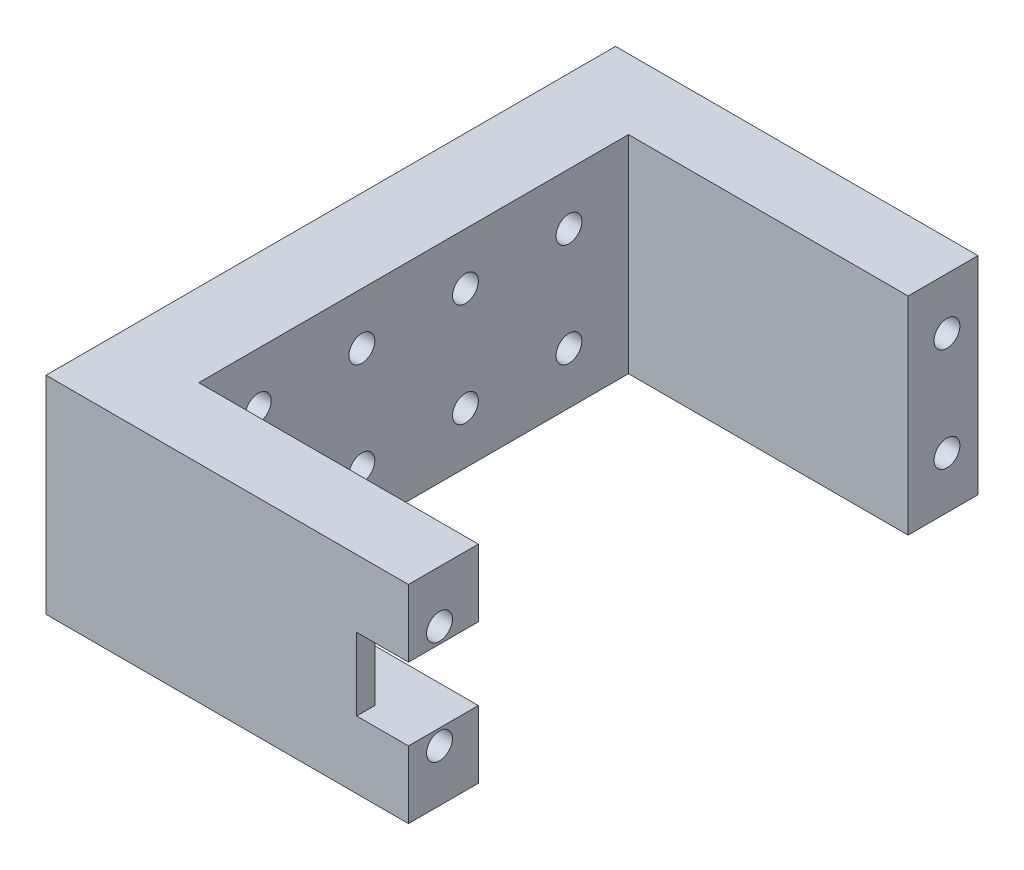
ISO-10303-21;
HEADER;
FILE_DESCRIPTION(('STEP AP214'),'2;1');
FILE_NAME('part.step','',(''),(''),'','','');
FILE_SCHEMA(('AUTOMOTIVE_DESIGN { 1 0 10303 214 1 1 1 1 }'));
ENDSEC;
DATA;
#1=APPLICATION_CONTEXT('core data for automotive mechanical design processes');
#2=APPLICATION_PROTOCOL_DEFINITION('international standard','automotive_design',2000,#1);
#3=PRODUCT_CONTEXT('',#1,'mechanical');
#4=PRODUCT('Part','Part','',(#3));
#5=PRODUCT_RELATED_PRODUCT_CATEGORY('part','',(#4));
#6=PRODUCT_DEFINITION_FORMATION('','',#4);
#7=PRODUCT_DEFINITION_CONTEXT('part definition',#1,'design');
#8=PRODUCT_DEFINITION('design','',#6,#7);
#9=PRODUCT_DEFINITION_SHAPE('','',#8);
#10=(LENGTH_UNIT() NAMED_UNIT(*) SI_UNIT(.MILLI.,.METRE.));
#11=(NAMED_UNIT(*) PLANE_ANGLE_UNIT() SI_UNIT($,.RADIAN.));
#12=(NAMED_UNIT(*) SI_UNIT($,.STERADIAN.) SOLID_ANGLE_UNIT());
#13=UNCERTAINTY_MEASURE_WITH_UNIT(LENGTH_MEASURE(1.E-05),#10,'distance_accuracy_value','');
#14=(GEOMETRIC_REPRESENTATION_CONTEXT(3) GLOBAL_UNCERTAINTY_ASSIGNED_CONTEXT((#13)) GLOBAL_UNIT_ASSIGNED_CONTEXT((#10,
#11,#12)) REPRESENTATION_CONTEXT('',''));
#15=CARTESIAN_POINT('',(0.,0.,0.));
#16=DIRECTION('',(0.,0.,1.));
#17=DIRECTION('',(1.,0.,0.));
#18=AXIS2_PLACEMENT_3D('',#15,#16,#17);
#19=CARTESIAN_POINT('',(17.5,0.,0.));
#20=DIRECTION('',(-1.,0.,0.));
#21=DIRECTION('',(0.,0.,1.));
#22=AXIS2_PLACEMENT_3D('',#19,#20,#21);
#23=PLANE('',#22);
#24=CARTESIAN_POINT('',(17.5,-5.,24.5));
#25=DIRECTION('',(1.,0.,0.));
#26=DIRECTION('',(0.,0.,-1.));
#27=AXIS2_PLACEMENT_3D('',#24,#25,#26);
#28=CIRCLE('',#27,1.25);
#29=CARTESIAN_POINT('',(17.5,-5.,23.25));
#30=VERTEX_POINT('',#29);
#31=EDGE_CURVE('E195',#30,#30,#28,.T.);
#32=ORIENTED_EDGE('',*,*,#31,.F.);
#33=EDGE_LOOP('',(#32));
#34=FACE_BOUND('',#33,.T.);
#35=DIRECTION('',(0.,0.,-1.));
#36=VECTOR('',#35,1.);
#37=CARTESIAN_POINT('',(17.5,-3.5,25.75));
#38=LINE('',#37,#36);
#39=CARTESIAN_POINT('',(17.5,-3.5,27.5));
#40=VERTEX_POINT('',#39);
#41=CARTESIAN_POINT('',(17.5,-3.5,20.75));
#42=VERTEX_POINT('',#41);
#43=EDGE_CURVE('E415',#40,#42,#38,.T.);
#44=ORIENTED_EDGE('',*,*,#43,.F.);
#45=DIRECTION('',(0.,-1.,0.));
#46=VECTOR('',#45,1.);
#47=CARTESIAN_POINT('',(17.5,-10.,27.5));
#48=LINE('',#47,#46);
#49=CARTESIAN_POINT('',(17.5,-10.,27.5));
#50=VERTEX_POINT('',#49);
#51=EDGE_CURVE('E248',#40,#50,#48,.T.);
#52=ORIENTED_EDGE('',*,*,#51,.T.);
#53=DIRECTION('',(0.,0.,-1.));
#54=VECTOR('',#53,1.);
#55=CARTESIAN_POINT('',(17.5,-10.,27.5));
#56=LINE('',#55,#54);
#57=CARTESIAN_POINT('',(17.5,-10.,20.75));
#58=VERTEX_POINT('',#57);
#59=EDGE_CURVE('E253',#50,#58,#56,.T.);
#60=ORIENTED_EDGE('',*,*,#59,.T.);
#61=DIRECTION('',(0.,1.,0.));
#62=VECTOR('',#61,1.);
#63=CARTESIAN_POINT('',(17.5,-10.,20.75));
#64=LINE('',#63,#62);
#65=EDGE_CURVE('E228',#58,#42,#64,.T.);
#66=ORIENTED_EDGE('',*,*,#65,.T.);
#67=EDGE_LOOP('',(#44,#52,#60,#66));
#68=FACE_BOUND('',#67,.T.);
#69=ADVANCED_FACE('F33',(#34,#68),#23,.F.);
#70=CARTESIAN_POINT('',(-18.1023252670426,3.5,25.75));
#71=DIRECTION('',(0.,0.,1.));
#72=DIRECTION('',(1.,0.,0.));
#73=AXIS2_PLACEMENT_3D('',#70,#71,#72);
#74=PLANE('',#73);
#75=DIRECTION('',(0.,1.,0.));
#76=VECTOR('',#75,1.);
#77=CARTESIAN_POINT('',(12.5,-3.5,25.75));
#78=LINE('',#77,#76);
#79=CARTESIAN_POINT('',(12.5,-3.5,25.75));
#80=VERTEX_POINT('',#79);
#81=CARTESIAN_POINT('',(12.5,3.5,25.75));
#82=VERTEX_POINT('',#81);
#83=EDGE_CURVE('E144',#80,#82,#78,.T.);
#84=ORIENTED_EDGE('',*,*,#83,.F.);
#85=DIRECTION('',(1.,0.,0.));
#86=VECTOR('',#85,1.);
#87=CARTESIAN_POINT('',(-18.1023252670426,-3.5,25.75));
#88=LINE('',#87,#86);
#89=CARTESIAN_POINT('',(-9.5,-3.5,25.75));
#90=VERTEX_POINT('',#89);
#91=EDGE_CURVE('E155',#90,#80,#88,.T.);
#92=ORIENTED_EDGE('',*,*,#91,.F.);
#93=DIRECTION('',(0.,-1.,0.));
#94=VECTOR('',#93,1.);
#95=CARTESIAN_POINT('',(-9.5,3.5,25.75));
#96=LINE('',#95,#94);
#97=CARTESIAN_POINT('',(-9.5,3.5,25.75));
#98=VERTEX_POINT('',#97);
#99=EDGE_CURVE('E152',#98,#90,#96,.T.);
#100=ORIENTED_EDGE('',*,*,#99,.F.);
#101=DIRECTION('',(1.,0.,0.));
#102=VECTOR('',#101,1.);
#103=CARTESIAN_POINT('',(-18.1023252670426,3.5,25.75));
#104=LINE('',#103,#102);
#105=EDGE_CURVE('E138',#98,#82,#104,.T.);
#106=ORIENTED_EDGE('',*,*,#105,.T.);
#107=EDGE_LOOP('',(#84,#92,#100,#106));
#108=FACE_BOUND('',#107,.T.);
#109=ADVANCED_FACE('F151',(#108),#74,.F.);
#110=CARTESIAN_POINT('',(17.5,-10.,20.75));
#111=DIRECTION('',(0.,0.,1.));
#112=DIRECTION('',(1.,0.,0.));
#113=AXIS2_PLACEMENT_3D('',#110,#111,#112);
#114=PLANE('',#113);
#115=DIRECTION('',(0.,1.,0.));
#116=VECTOR('',#115,1.);
#117=CARTESIAN_POINT('',(-9.5,-10.,20.75));
#118=LINE('',#117,#116);
#119=CARTESIAN_POINT('',(-9.5,-10.,20.75));
#120=VERTEX_POINT('',#119);
#121=CARTESIAN_POINT('',(-9.5,-3.5,20.75));
#122=VERTEX_POINT('',#121);
#123=EDGE_CURVE('E233',#120,#122,#118,.T.);
#124=ORIENTED_EDGE('',*,*,#123,.T.);
#125=DIRECTION('',(1.,0.,0.));
#126=VECTOR('',#125,1.);
#127=CARTESIAN_POINT('',(-18.1023252670426,-3.5,20.75));
#128=LINE('',#127,#126);
#129=EDGE_CURVE('E161',#122,#42,#128,.T.);
#130=ORIENTED_EDGE('',*,*,#129,.T.);
#131=ORIENTED_EDGE('',*,*,#65,.F.);
#132=DIRECTION('',(1.,0.,0.));
#133=VECTOR('',#132,1.);
#134=CARTESIAN_POINT('',(17.5,-10.,20.75));
#135=LINE('',#134,#133);
#136=EDGE_CURVE('E217',#120,#58,#135,.T.);
#137=ORIENTED_EDGE('',*,*,#136,.F.);
#138=EDGE_LOOP('',(#124,#130,#131,#137));
#139=FACE_BOUND('',#138,.T.);
#140=ADVANCED_FACE('F314',(#139),#114,.F.);
#141=CARTESIAN_POINT('',(-5.5,5.,-15.));
#142=DIRECTION('',(-1.,0.,0.));
#143=DIRECTION('',(0.,0.,1.));
#144=AXIS2_PLACEMENT_3D('',#141,#142,#143);
#145=CYLINDRICAL_SURFACE('',#144,1.25);
#146=CARTESIAN_POINT('',(-17.5,5.,-15.));
#147=DIRECTION('',(-1.,0.,0.));
#148=DIRECTION('',(0.,0.,1.));
#149=AXIS2_PLACEMENT_3D('',#146,#147,#148);
#150=CIRCLE('',#149,1.25);
#151=CARTESIAN_POINT('',(-17.5,5.,-13.75));
#152=VERTEX_POINT('',#151);
#153=EDGE_CURVE('E41',#152,#152,#150,.T.);
#154=ORIENTED_EDGE('',*,*,#153,.T.);
#155=EDGE_LOOP('',(#154));
#156=FACE_BOUND('',#155,.T.);
#157=CARTESIAN_POINT('',(-9.5,5.,-15.));
#158=DIRECTION('',(-1.,0.,0.));
#159=DIRECTION('',(0.,0.,1.));
#160=AXIS2_PLACEMENT_3D('',#157,#158,#159);
#161=CIRCLE('',#160,1.25);
#162=CARTESIAN_POINT('',(-9.5,5.,-13.75));
#163=VERTEX_POINT('',#162);
#164=EDGE_CURVE('E11',#163,#163,#161,.T.);
#165=ORIENTED_EDGE('',*,*,#164,.F.);
#166=EDGE_LOOP('',(#165));
#167=FACE_BOUND('',#166,.T.);
#168=ADVANCED_FACE('F35',(#156,#167),#145,.F.);
#169=CARTESIAN_POINT('',(-5.5,5.,-5.));
#170=DIRECTION('',(-1.,0.,0.));
#171=DIRECTION('',(0.,0.,1.));
#172=AXIS2_PLACEMENT_3D('',#169,#170,#171);
#173=CYLINDRICAL_SURFACE('',#172,1.25);
#174=CARTESIAN_POINT('',(-17.5,5.,-5.));
#175=DIRECTION('',(-1.,0.,0.));
#176=DIRECTION('',(0.,0.,1.));
#177=AXIS2_PLACEMENT_3D('',#174,#175,#176);
#178=CIRCLE('',#177,1.25);
#179=CARTESIAN_POINT('',(-17.5,5.,-3.75));
#180=VERTEX_POINT('',#179);
#181=EDGE_CURVE('E291',#180,#180,#178,.T.);
#182=ORIENTED_EDGE('',*,*,#181,.T.);
#183=EDGE_LOOP('',(#182));
#184=FACE_BOUND('',#183,.T.);
#185=CARTESIAN_POINT('',(-9.5,5.,-5.));
#186=DIRECTION('',(-1.,0.,0.));
#187=DIRECTION('',(0.,0.,1.));
#188=AXIS2_PLACEMENT_3D('',#185,#186,#187);
#189=CIRCLE('',#188,1.25);
#190=CARTESIAN_POINT('',(-9.5,5.,-3.75));
#191=VERTEX_POINT('',#190);
#192=EDGE_CURVE('E294',#191,#191,#189,.T.);
#193=ORIENTED_EDGE('',*,*,#192,.F.);
#194=EDGE_LOOP('',(#193));
#195=FACE_BOUND('',#194,.T.);
#196=ADVANCED_FACE('F390',(#184,#195),#173,.F.);
#197=CARTESIAN_POINT('',(-5.5,-5.,-15.));
#198=DIRECTION('',(-1.,0.,0.));
#199=DIRECTION('',(0.,0.,1.));
#200=AXIS2_PLACEMENT_3D('',#197,#198,#199);
#201=CYLINDRICAL_SURFACE('',#200,1.25);
#202=CARTESIAN_POINT('',(-17.5,-5.,-15.));
#203=DIRECTION('',(-1.,0.,0.));
#204=DIRECTION('',(0.,0.,1.));
#205=AXIS2_PLACEMENT_3D('',#202,#203,#204);
#206=CIRCLE('',#205,1.25);
#207=CARTESIAN_POINT('',(-17.5,-5.,-13.75));
#208=VERTEX_POINT('',#207);
#209=EDGE_CURVE('E285',#208,#208,#206,.T.);
#210=ORIENTED_EDGE('',*,*,#209,.T.);
#211=EDGE_LOOP('',(#210));
#212=FACE_BOUND('',#211,.T.);
#213=CARTESIAN_POINT('',(-9.5,-5.,-15.));
#214=DIRECTION('',(-1.,0.,0.));
#215=DIRECTION('',(0.,0.,1.));
#216=AXIS2_PLACEMENT_3D('',#213,#214,#215);
#217=CIRCLE('',#216,1.25);
#218=CARTESIAN_POINT('',(-9.5,-5.,-13.75));
#219=VERTEX_POINT('',#218);
#220=EDGE_CURVE('E288',#219,#219,#217,.T.);
#221=ORIENTED_EDGE('',*,*,#220,.F.);
#222=EDGE_LOOP('',(#221));
#223=FACE_BOUND('',#222,.T.);
#224=ADVANCED_FACE('F342',(#212,#223),#201,.F.);
#225=CARTESIAN_POINT('',(-5.5,-5.,-5.));
#226=DIRECTION('',(-1.,0.,0.));
#227=DIRECTION('',(0.,0.,1.));
#228=AXIS2_PLACEMENT_3D('',#225,#226,#227);
#229=CYLINDRICAL_SURFACE('',#228,1.25);
#230=CARTESIAN_POINT('',(-17.5,-5.,-5.));
#231=DIRECTION('',(-1.,0.,0.));
#232=DIRECTION('',(0.,0.,1.));
#233=AXIS2_PLACEMENT_3D('',#230,#231,#232);
#234=CIRCLE('',#233,1.25);
#235=CARTESIAN_POINT('',(-17.5,-5.,-3.75));
#236=VERTEX_POINT('',#235);
#237=EDGE_CURVE('E275',#236,#236,#234,.T.);
#238=ORIENTED_EDGE('',*,*,#237,.T.);
#239=EDGE_LOOP('',(#238));
#240=FACE_BOUND('',#239,.T.);
#241=CARTESIAN_POINT('',(-9.5,-5.,-5.));
#242=DIRECTION('',(-1.,0.,0.));
#243=DIRECTION('',(0.,0.,1.));
#244=AXIS2_PLACEMENT_3D('',#241,#242,#243);
#245=CIRCLE('',#244,1.25);
#246=CARTESIAN_POINT('',(-9.5,-5.,-3.75));
#247=VERTEX_POINT('',#246);
#248=EDGE_CURVE('E282',#247,#247,#245,.T.);
#249=ORIENTED_EDGE('',*,*,#248,.F.);
#250=EDGE_LOOP('',(#249));
#251=FACE_BOUND('',#250,.T.);
#252=ADVANCED_FACE('F333',(#240,#251),#229,.F.);
#253=CARTESIAN_POINT('',(17.5,10.,27.5));
#254=VERTEX_POINT('',#253);
#255=CARTESIAN_POINT('',(17.5,3.5,27.5));
#256=VERTEX_POINT('',#255);
#257=EDGE_CURVE('E249',#254,#256,#48,.T.);
#258=ORIENTED_EDGE('',*,*,#257,.T.);
#259=DIRECTION('',(0.,0.,1.));
#260=VECTOR('',#259,1.);
#261=CARTESIAN_POINT('',(17.5,3.5,25.75));
#262=LINE('',#261,#260);
#263=CARTESIAN_POINT('',(17.5,3.5,20.75));
#264=VERTEX_POINT('',#263);
#265=EDGE_CURVE('E414',#264,#256,#262,.T.);
#266=ORIENTED_EDGE('',*,*,#265,.F.);
#267=CARTESIAN_POINT('',(17.5,10.,20.75));
#268=VERTEX_POINT('',#267);
#269=EDGE_CURVE('E232',#264,#268,#64,.T.);
#270=ORIENTED_EDGE('',*,*,#269,.T.);
#271=DIRECTION('',(0.,0.,1.));
#272=VECTOR('',#271,1.);
#273=CARTESIAN_POINT('',(17.5,10.,27.5));
#274=LINE('',#273,#272);
#275=EDGE_CURVE('E243',#268,#254,#274,.T.);
#276=ORIENTED_EDGE('',*,*,#275,.T.);
#277=EDGE_LOOP('',(#258,#266,#270,#276));
#278=FACE_BOUND('',#277,.T.);
#279=CARTESIAN_POINT('',(17.5,5.,24.5));
#280=DIRECTION('',(1.,0.,0.));
#281=DIRECTION('',(0.,0.,-1.));
#282=AXIS2_PLACEMENT_3D('',#279,#280,#281);
#283=CIRCLE('',#282,1.25);
#284=CARTESIAN_POINT('',(17.5,5.,23.25));
#285=VERTEX_POINT('',#284);
#286=EDGE_CURVE('E201',#285,#285,#283,.T.);
#287=ORIENTED_EDGE('',*,*,#286,.F.);
#288=EDGE_LOOP('',(#287));
#289=FACE_BOUND('',#288,.T.);
#290=ADVANCED_FACE('F318',(#278,#289),#23,.F.);
#291=CARTESIAN_POINT('',(17.5,-10.,-27.5));
#292=DIRECTION('',(0.,0.,1.));
#293=DIRECTION('',(1.,0.,0.));
#294=AXIS2_PLACEMENT_3D('',#291,#292,#293);
#295=PLANE('',#294);
#296=DIRECTION('',(0.,1.,0.));
#297=VECTOR('',#296,1.);
#298=CARTESIAN_POINT('',(-17.5,-10.,-27.5));
#299=LINE('',#298,#297);
#300=CARTESIAN_POINT('',(-17.5,-10.,-27.5));
#301=VERTEX_POINT('',#300);
#302=CARTESIAN_POINT('',(-17.5,10.,-27.5));
#303=VERTEX_POINT('',#302);
#304=EDGE_CURVE('E231',#301,#303,#299,.T.);
#305=ORIENTED_EDGE('',*,*,#304,.T.);
#306=DIRECTION('',(-1.,0.,0.));
#307=VECTOR('',#306,1.);
#308=CARTESIAN_POINT('',(17.5,10.,-27.5));
#309=LINE('',#308,#307);
#310=CARTESIAN_POINT('',(17.5,10.,-27.5));
#311=VERTEX_POINT('',#310);
#312=EDGE_CURVE('E272',#311,#303,#309,.T.);
#313=ORIENTED_EDGE('',*,*,#312,.F.);
#314=DIRECTION('',(0.,1.,0.));
#315=VECTOR('',#314,1.);
#316=CARTESIAN_POINT('',(17.5,-10.,-27.5));
#317=LINE('',#316,#315);
#318=CARTESIAN_POINT('',(17.5,-10.,-27.5));
#319=VERTEX_POINT('',#318);
#320=EDGE_CURVE('E240',#319,#311,#317,.T.);
#321=ORIENTED_EDGE('',*,*,#320,.F.);
#322=DIRECTION('',(-1.,0.,0.));
#323=VECTOR('',#322,1.);
#324=CARTESIAN_POINT('',(17.5,-10.,-27.5));
#325=LINE('',#324,#323);
#326=EDGE_CURVE('E256',#319,#301,#325,.T.);
#327=ORIENTED_EDGE('',*,*,#326,.T.);
#328=EDGE_LOOP('',(#305,#313,#321,#327));
#329=FACE_BOUND('',#328,.T.);
#330=ADVANCED_FACE('F332',(#329),#295,.F.);
#331=CARTESIAN_POINT('',(17.5,10.,27.5));
#332=DIRECTION('',(0.,-1.,0.));
#333=DIRECTION('',(0.,0.,-1.));
#334=AXIS2_PLACEMENT_3D('',#331,#332,#333);
#335=PLANE('',#334);
#336=ORIENTED_EDGE('',*,*,#275,.F.);
#337=DIRECTION('',(1.,0.,0.));
#338=VECTOR('',#337,1.);
#339=CARTESIAN_POINT('',(17.5,10.,20.75));
#340=LINE('',#339,#338);
#341=CARTESIAN_POINT('',(-9.5,10.,20.75));
#342=VERTEX_POINT('',#341);
#343=EDGE_CURVE('E214',#342,#268,#340,.T.);
#344=ORIENTED_EDGE('',*,*,#343,.F.);
#345=DIRECTION('',(0.,0.,1.));
#346=VECTOR('',#345,1.);
#347=CARTESIAN_POINT('',(-9.5,10.,-20.75));
#348=LINE('',#347,#346);
#349=CARTESIAN_POINT('',(-9.5,10.,-20.75));
#350=VERTEX_POINT('',#349);
#351=EDGE_CURVE('E223',#350,#342,#348,.T.);
#352=ORIENTED_EDGE('',*,*,#351,.F.);
#353=DIRECTION('',(-1.,0.,0.));
#354=VECTOR('',#353,1.);
#355=CARTESIAN_POINT('',(17.5,10.,-20.75));
#356=LINE('',#355,#354);
#357=CARTESIAN_POINT('',(17.5,10.,-20.75));
#358=VERTEX_POINT('',#357);
#359=EDGE_CURVE('E207',#358,#350,#356,.T.);
#360=ORIENTED_EDGE('',*,*,#359,.F.);
#361=EDGE_CURVE('E245',#311,#358,#274,.T.);
#362=ORIENTED_EDGE('',*,*,#361,.F.);
#363=ORIENTED_EDGE('',*,*,#312,.T.);
#364=DIRECTION('',(0.,0.,1.));
#365=VECTOR('',#364,1.);
#366=CARTESIAN_POINT('',(-17.5,10.,27.5));
#367=LINE('',#366,#365);
#368=CARTESIAN_POINT('',(-17.5,10.,27.5));
#369=VERTEX_POINT('',#368);
#370=EDGE_CURVE('E259',#303,#369,#367,.T.);
#371=ORIENTED_EDGE('',*,*,#370,.T.);
#372=DIRECTION('',(-1.,0.,0.));
#373=VECTOR('',#372,1.);
#374=CARTESIAN_POINT('',(17.5,10.,27.5));
#375=LINE('',#374,#373);
#376=EDGE_CURVE('E269',#254,#369,#375,.T.);
#377=ORIENTED_EDGE('',*,*,#376,.F.);
#378=EDGE_LOOP('',(#336,#344,#352,#360,#362,#363,#371,#377));
#379=FACE_BOUND('',#378,.T.);
#380=ADVANCED_FACE('F339',(#379),#335,.F.);
#381=CARTESIAN_POINT('',(17.5,-10.,27.5));
#382=DIRECTION('',(0.,0.,-1.));
#383=DIRECTION('',(-1.,0.,0.));
#384=AXIS2_PLACEMENT_3D('',#381,#382,#383);
#385=PLANE('',#384);
#386=ORIENTED_EDGE('',*,*,#51,.F.);
#387=DIRECTION('',(1.,0.,0.));
#388=VECTOR('',#387,1.);
#389=CARTESIAN_POINT('',(12.5,-3.5,27.5));
#390=LINE('',#389,#388);
#391=CARTESIAN_POINT('',(12.5,-3.5,27.5));
#392=VERTEX_POINT('',#391);
#393=EDGE_CURVE('E418',#392,#40,#390,.T.);
#394=ORIENTED_EDGE('',*,*,#393,.F.);
#395=DIRECTION('',(0.,-1.,0.));
#396=VECTOR('',#395,1.);
#397=CARTESIAN_POINT('',(12.5,-3.5,27.5));
#398=LINE('',#397,#396);
#399=CARTESIAN_POINT('',(12.5,3.5,27.5));
#400=VERTEX_POINT('',#399);
#401=EDGE_CURVE('E143',#400,#392,#398,.T.);
#402=ORIENTED_EDGE('',*,*,#401,.F.);
#403=DIRECTION('',(1.,0.,0.));
#404=VECTOR('',#403,1.);
#405=CARTESIAN_POINT('',(12.5,3.5,27.5));
#406=LINE('',#405,#404);
#407=EDGE_CURVE('E141',#400,#256,#406,.T.);
#408=ORIENTED_EDGE('',*,*,#407,.T.);
#409=ORIENTED_EDGE('',*,*,#257,.F.);
#410=ORIENTED_EDGE('',*,*,#376,.T.);
#411=DIRECTION('',(0.,-1.,0.));
#412=VECTOR('',#411,1.);
#413=CARTESIAN_POINT('',(-17.5,-10.,27.5));
#414=LINE('',#413,#412);
#415=CARTESIAN_POINT('',(-17.5,-10.,27.5));
#416=VERTEX_POINT('',#415);
#417=EDGE_CURVE('E261',#369,#416,#414,.T.);
#418=ORIENTED_EDGE('',*,*,#417,.T.);
#419=DIRECTION('',(-1.,0.,0.));
#420=VECTOR('',#419,1.);
#421=CARTESIAN_POINT('',(17.5,-10.,27.5));
#422=LINE('',#421,#420);
#423=EDGE_CURVE('E266',#50,#416,#422,.T.);
#424=ORIENTED_EDGE('',*,*,#423,.F.);
#425=EDGE_LOOP('',(#386,#394,#402,#408,#409,#410,#418,#424));
#426=FACE_BOUND('',#425,.T.);
#427=ADVANCED_FACE('F430',(#426),#385,.F.);
#428=CARTESIAN_POINT('',(17.5,-10.,27.5));
#429=DIRECTION('',(0.,1.,0.));
#430=DIRECTION('',(0.,0.,1.));
#431=AXIS2_PLACEMENT_3D('',#428,#429,#430);
#432=PLANE('',#431);
#433=DIRECTION('',(0.,0.,1.));
#434=VECTOR('',#433,1.);
#435=CARTESIAN_POINT('',(-9.5,-10.,-20.75));
#436=LINE('',#435,#434);
#437=CARTESIAN_POINT('',(-9.5,-10.,-20.75));
#438=VERTEX_POINT('',#437);
#439=EDGE_CURVE('E213',#438,#120,#436,.T.);
#440=ORIENTED_EDGE('',*,*,#439,.T.);
#441=ORIENTED_EDGE('',*,*,#136,.T.);
#442=ORIENTED_EDGE('',*,*,#59,.F.);
#443=ORIENTED_EDGE('',*,*,#423,.T.);
#444=DIRECTION('',(0.,0.,-1.));
#445=VECTOR('',#444,1.);
#446=CARTESIAN_POINT('',(-17.5,-10.,27.5));
#447=LINE('',#446,#445);
#448=EDGE_CURVE('E244',#416,#301,#447,.T.);
#449=ORIENTED_EDGE('',*,*,#448,.T.);
#450=ORIENTED_EDGE('',*,*,#326,.F.);
#451=CARTESIAN_POINT('',(17.5,-10.,-20.75));
#452=VERTEX_POINT('',#451);
#453=EDGE_CURVE('E252',#452,#319,#56,.T.);
#454=ORIENTED_EDGE('',*,*,#453,.F.);
#455=DIRECTION('',(-1.,0.,0.));
#456=VECTOR('',#455,1.);
#457=CARTESIAN_POINT('',(17.5,-10.,-20.75));
#458=LINE('',#457,#456);
#459=EDGE_CURVE('E210',#452,#438,#458,.T.);
#460=ORIENTED_EDGE('',*,*,#459,.T.);
#461=EDGE_LOOP('',(#440,#441,#442,#443,#449,#450,#454,#460));
#462=FACE_BOUND('',#461,.T.);
#463=ADVANCED_FACE('F315',(#462),#432,.F.);
#464=CARTESIAN_POINT('',(17.5,-5.,-24.5));
#465=DIRECTION('',(-1.,0.,0.));
#466=DIRECTION('',(0.,0.,1.));
#467=AXIS2_PLACEMENT_3D('',#464,#465,#466);
#468=CIRCLE('',#467,1.25);
#469=CARTESIAN_POINT('',(17.5,-5.,-23.25));
#470=VERTEX_POINT('',#469);
#471=EDGE_CURVE('E189',#470,#470,#468,.T.);
#472=ORIENTED_EDGE('',*,*,#471,.T.);
#473=EDGE_LOOP('',(#472));
#474=FACE_BOUND('',#473,.T.);
#475=CARTESIAN_POINT('',(17.5,5.,-24.5));
#476=DIRECTION('',(-1.,0.,0.));
#477=DIRECTION('',(0.,0.,1.));
#478=AXIS2_PLACEMENT_3D('',#475,#476,#477);
#479=CIRCLE('',#478,1.25);
#480=CARTESIAN_POINT('',(17.5,5.,-23.25));
#481=VERTEX_POINT('',#480);
#482=EDGE_CURVE('E188',#481,#481,#479,.T.);
#483=ORIENTED_EDGE('',*,*,#482,.T.);
#484=EDGE_LOOP('',(#483));
#485=FACE_BOUND('',#484,.T.);
#486=ORIENTED_EDGE('',*,*,#361,.T.);
#487=DIRECTION('',(0.,1.,0.));
#488=VECTOR('',#487,1.);
#489=CARTESIAN_POINT('',(17.5,-10.,-20.75));
#490=LINE('',#489,#488);
#491=EDGE_CURVE('E220',#452,#358,#490,.T.);
#492=ORIENTED_EDGE('',*,*,#491,.F.);
#493=ORIENTED_EDGE('',*,*,#453,.T.);
#494=ORIENTED_EDGE('',*,*,#320,.T.);
#495=EDGE_LOOP('',(#486,#492,#493,#494));
#496=FACE_BOUND('',#495,.T.);
#497=ADVANCED_FACE('F304',(#474,#485,#496),#23,.F.);
#498=CARTESIAN_POINT('',(-17.5,0.,0.));
#499=DIRECTION('',(-1.,0.,0.));
#500=DIRECTION('',(0.,0.,1.));
#501=AXIS2_PLACEMENT_3D('',#498,#499,#500);
#502=PLANE('',#501);
#503=CARTESIAN_POINT('',(-17.5,5.,5.));
#504=DIRECTION('',(-1.,0.,0.));
#505=DIRECTION('',(0.,0.,1.));
#506=AXIS2_PLACEMENT_3D('',#503,#504,#505);
#507=CIRCLE('',#506,1.25);
#508=CARTESIAN_POINT('',(-17.5,5.,6.25));
#509=VERTEX_POINT('',#508);
#510=EDGE_CURVE('E165',#509,#509,#507,.T.);
#511=ORIENTED_EDGE('',*,*,#510,.F.);
#512=EDGE_LOOP('',(#511));
#513=FACE_BOUND('',#512,.T.);
#514=CARTESIAN_POINT('',(-17.5,-5.,5.));
#515=DIRECTION('',(-1.,0.,0.));
#516=DIRECTION('',(0.,0.,1.));
#517=AXIS2_PLACEMENT_3D('',#514,#515,#516);
#518=CIRCLE('',#517,1.25);
#519=CARTESIAN_POINT('',(-17.5,-5.,6.25));
#520=VERTEX_POINT('',#519);
#521=EDGE_CURVE('E171',#520,#520,#518,.T.);
#522=ORIENTED_EDGE('',*,*,#521,.F.);
#523=EDGE_LOOP('',(#522));
#524=FACE_BOUND('',#523,.T.);
#525=CARTESIAN_POINT('',(-17.5,-5.,15.));
#526=DIRECTION('',(-1.,0.,0.));
#527=DIRECTION('',(0.,0.,1.));
#528=AXIS2_PLACEMENT_3D('',#525,#526,#527);
#529=CIRCLE('',#528,1.25);
#530=CARTESIAN_POINT('',(-17.5,-5.,16.25));
#531=VERTEX_POINT('',#530);
#532=EDGE_CURVE('E177',#531,#531,#529,.T.);
#533=ORIENTED_EDGE('',*,*,#532,.F.);
#534=EDGE_LOOP('',(#533));
#535=FACE_BOUND('',#534,.T.);
#536=CARTESIAN_POINT('',(-17.5,5.,15.));
#537=DIRECTION('',(-1.,0.,0.));
#538=DIRECTION('',(0.,0.,1.));
#539=AXIS2_PLACEMENT_3D('',#536,#537,#538);
#540=CIRCLE('',#539,1.25);
#541=CARTESIAN_POINT('',(-17.5,5.,16.25));
#542=VERTEX_POINT('',#541);
#543=EDGE_CURVE('E181',#542,#542,#540,.T.);
#544=ORIENTED_EDGE('',*,*,#543,.F.);
#545=EDGE_LOOP('',(#544));
#546=FACE_BOUND('',#545,.T.);
#547=ORIENTED_EDGE('',*,*,#304,.F.);
#548=ORIENTED_EDGE('',*,*,#448,.F.);
#549=ORIENTED_EDGE('',*,*,#417,.F.);
#550=ORIENTED_EDGE('',*,*,#370,.F.);
#551=EDGE_LOOP('',(#547,#548,#549,#550));
#552=FACE_BOUND('',#551,.T.);
#553=ORIENTED_EDGE('',*,*,#237,.F.);
#554=EDGE_LOOP('',(#553));
#555=FACE_BOUND('',#554,.T.);
#556=ORIENTED_EDGE('',*,*,#209,.F.);
#557=EDGE_LOOP('',(#556));
#558=FACE_BOUND('',#557,.T.);
#559=ORIENTED_EDGE('',*,*,#181,.F.);
#560=EDGE_LOOP('',(#559));
#561=FACE_BOUND('',#560,.T.);
#562=ORIENTED_EDGE('',*,*,#153,.F.);
#563=EDGE_LOOP('',(#562));
#564=FACE_BOUND('',#563,.T.);
#565=ADVANCED_FACE('F301',(#513,#524,#535,#546,#552,#555,#558,#561,#564),#502,.T.);
#566=ORIENTED_EDGE('',*,*,#269,.F.);
#567=DIRECTION('',(1.,0.,0.));
#568=VECTOR('',#567,1.);
#569=CARTESIAN_POINT('',(-18.1023252670426,3.5,20.75));
#570=LINE('',#569,#568);
#571=CARTESIAN_POINT('',(-9.5,3.5,20.75));
#572=VERTEX_POINT('',#571);
#573=EDGE_CURVE('E157',#572,#264,#570,.T.);
#574=ORIENTED_EDGE('',*,*,#573,.F.);
#575=EDGE_CURVE('E236',#572,#342,#118,.T.);
#576=ORIENTED_EDGE('',*,*,#575,.T.);
#577=ORIENTED_EDGE('',*,*,#343,.T.);
#578=EDGE_LOOP('',(#566,#574,#576,#577));
#579=FACE_BOUND('',#578,.T.);
#580=ADVANCED_FACE('F303',(#579),#114,.F.);
#581=CARTESIAN_POINT('',(-9.5,-10.,-20.75));
#582=DIRECTION('',(-1.,0.,0.));
#583=DIRECTION('',(0.,0.,1.));
#584=AXIS2_PLACEMENT_3D('',#581,#582,#583);
#585=PLANE('',#584);
#586=CARTESIAN_POINT('',(-9.5,5.,5.));
#587=DIRECTION('',(-1.,0.,0.));
#588=DIRECTION('',(0.,0.,1.));
#589=AXIS2_PLACEMENT_3D('',#586,#587,#588);
#590=CIRCLE('',#589,1.25);
#591=CARTESIAN_POINT('',(-9.5,5.,6.25));
#592=VERTEX_POINT('',#591);
#593=EDGE_CURVE('E168',#592,#592,#590,.T.);
#594=ORIENTED_EDGE('',*,*,#593,.T.);
#595=EDGE_LOOP('',(#594));
#596=FACE_BOUND('',#595,.T.);
#597=CARTESIAN_POINT('',(-9.5,-5.,5.));
#598=DIRECTION('',(-1.,0.,0.));
#599=DIRECTION('',(0.,0.,1.));
#600=AXIS2_PLACEMENT_3D('',#597,#598,#599);
#601=CIRCLE('',#600,1.25);
#602=CARTESIAN_POINT('',(-9.5,-5.,6.25));
#603=VERTEX_POINT('',#602);
#604=EDGE_CURVE('E174',#603,#603,#601,.T.);
#605=ORIENTED_EDGE('',*,*,#604,.T.);
#606=EDGE_LOOP('',(#605));
#607=FACE_BOUND('',#606,.T.);
#608=CARTESIAN_POINT('',(-9.5,-5.,15.));
#609=DIRECTION('',(-1.,0.,0.));
#610=DIRECTION('',(0.,0.,1.));
#611=AXIS2_PLACEMENT_3D('',#608,#609,#610);
#612=CIRCLE('',#611,1.25);
#613=CARTESIAN_POINT('',(-9.5,-5.,16.25));
#614=VERTEX_POINT('',#613);
#615=EDGE_CURVE('E180',#614,#614,#612,.T.);
#616=ORIENTED_EDGE('',*,*,#615,.T.);
#617=EDGE_LOOP('',(#616));
#618=FACE_BOUND('',#617,.T.);
#619=CARTESIAN_POINT('',(-9.5,5.,15.));
#620=DIRECTION('',(-1.,0.,0.));
#621=DIRECTION('',(0.,0.,1.));
#622=AXIS2_PLACEMENT_3D('',#619,#620,#621);
#623=CIRCLE('',#622,1.25);
#624=CARTESIAN_POINT('',(-9.5,5.,16.25));
#625=VERTEX_POINT('',#624);
#626=EDGE_CURVE('E184',#625,#625,#623,.T.);
#627=ORIENTED_EDGE('',*,*,#626,.T.);
#628=EDGE_LOOP('',(#627));
#629=FACE_BOUND('',#628,.T.);
#630=ORIENTED_EDGE('',*,*,#351,.T.);
#631=ORIENTED_EDGE('',*,*,#575,.F.);
#632=DIRECTION('',(0.,0.,1.));
#633=VECTOR('',#632,1.);
#634=CARTESIAN_POINT('',(-9.5,3.5,25.75));
#635=LINE('',#634,#633);
#636=EDGE_CURVE('E153',#572,#98,#635,.T.);
#637=ORIENTED_EDGE('',*,*,#636,.T.);
#638=ORIENTED_EDGE('',*,*,#99,.T.);
#639=DIRECTION('',(0.,0.,-1.));
#640=VECTOR('',#639,1.);
#641=CARTESIAN_POINT('',(-9.5,-3.5,25.75));
#642=LINE('',#641,#640);
#643=EDGE_CURVE('E56',#90,#122,#642,.T.);
#644=ORIENTED_EDGE('',*,*,#643,.T.);
#645=ORIENTED_EDGE('',*,*,#123,.F.);
#646=ORIENTED_EDGE('',*,*,#439,.F.);
#647=DIRECTION('',(0.,1.,0.));
#648=VECTOR('',#647,1.);
#649=CARTESIAN_POINT('',(-9.5,-10.,-20.75));
#650=LINE('',#649,#648);
#651=EDGE_CURVE('E237',#438,#350,#650,.T.);
#652=ORIENTED_EDGE('',*,*,#651,.T.);
#653=EDGE_LOOP('',(#630,#631,#637,#638,#644,#645,#646,#652));
#654=FACE_BOUND('',#653,.T.);
#655=ORIENTED_EDGE('',*,*,#248,.T.);
#656=EDGE_LOOP('',(#655));
#657=FACE_BOUND('',#656,.T.);
#658=ORIENTED_EDGE('',*,*,#220,.T.);
#659=EDGE_LOOP('',(#658));
#660=FACE_BOUND('',#659,.T.);
#661=ORIENTED_EDGE('',*,*,#192,.T.);
#662=EDGE_LOOP('',(#661));
#663=FACE_BOUND('',#662,.T.);
#664=ORIENTED_EDGE('',*,*,#164,.T.);
#665=EDGE_LOOP('',(#664));
#666=FACE_BOUND('',#665,.T.);
#667=ADVANCED_FACE('F311',(#596,#607,#618,#629,#654,#657,#660,#663,#666),#585,.F.);
#668=CARTESIAN_POINT('',(17.5,-10.,-20.75));
#669=DIRECTION('',(0.,0.,-1.));
#670=DIRECTION('',(-1.,0.,0.));
#671=AXIS2_PLACEMENT_3D('',#668,#669,#670);
#672=PLANE('',#671);
#673=ORIENTED_EDGE('',*,*,#359,.T.);
#674=ORIENTED_EDGE('',*,*,#651,.F.);
#675=ORIENTED_EDGE('',*,*,#459,.F.);
#676=ORIENTED_EDGE('',*,*,#491,.T.);
#677=EDGE_LOOP('',(#673,#674,#675,#676));
#678=FACE_BOUND('',#677,.T.);
#679=ADVANCED_FACE('F353',(#678),#672,.F.);
#680=CARTESIAN_POINT('',(5.5,5.,24.5));
#681=DIRECTION('',(1.,0.,0.));
#682=DIRECTION('',(0.,0.,-1.));
#683=AXIS2_PLACEMENT_3D('',#680,#681,#682);
#684=CYLINDRICAL_SURFACE('',#683,1.25);
#685=CARTESIAN_POINT('',(5.5,5.,24.5));
#686=DIRECTION('',(1.,0.,0.));
#687=DIRECTION('',(0.,0.,-1.));
#688=AXIS2_PLACEMENT_3D('',#685,#686,#687);
#689=CIRCLE('',#688,1.25);
#690=CARTESIAN_POINT('',(5.5,5.,23.25));
#691=VERTEX_POINT('',#690);
#692=EDGE_CURVE('E204',#691,#691,#689,.T.);
#693=ORIENTED_EDGE('',*,*,#692,.F.);
#694=EDGE_LOOP('',(#693));
#695=FACE_BOUND('',#694,.T.);
#696=ORIENTED_EDGE('',*,*,#286,.T.);
#697=EDGE_LOOP('',(#696));
#698=FACE_BOUND('',#697,.T.);
#699=ADVANCED_FACE('F350',(#695,#698),#684,.F.);
#700=CARTESIAN_POINT('',(5.5,5.,24.5));
#701=DIRECTION('',(1.,0.,0.));
#702=DIRECTION('',(0.,0.,-1.));
#703=AXIS2_PLACEMENT_3D('',#700,#701,#702);
#704=PLANE('',#703);
#705=ORIENTED_EDGE('',*,*,#692,.T.);
#706=EDGE_LOOP('',(#705));
#707=FACE_BOUND('',#706,.T.);
#708=ADVANCED_FACE('F352',(#707),#704,.T.);
#709=CARTESIAN_POINT('',(5.5,-5.,24.5));
#710=DIRECTION('',(1.,0.,0.));
#711=DIRECTION('',(0.,0.,-1.));
#712=AXIS2_PLACEMENT_3D('',#709,#710,#711);
#713=CYLINDRICAL_SURFACE('',#712,1.25);
#714=CARTESIAN_POINT('',(5.5,-5.,24.5));
#715=DIRECTION('',(1.,0.,0.));
#716=DIRECTION('',(0.,0.,-1.));
#717=AXIS2_PLACEMENT_3D('',#714,#715,#716);
#718=CIRCLE('',#717,1.25);
#719=CARTESIAN_POINT('',(5.5,-5.,23.25));
#720=VERTEX_POINT('',#719);
#721=EDGE_CURVE('E198',#720,#720,#718,.T.);
#722=ORIENTED_EDGE('',*,*,#721,.F.);
#723=EDGE_LOOP('',(#722));
#724=FACE_BOUND('',#723,.T.);
#725=ORIENTED_EDGE('',*,*,#31,.T.);
#726=EDGE_LOOP('',(#725));
#727=FACE_BOUND('',#726,.T.);
#728=ADVANCED_FACE('F360',(#724,#727),#713,.F.);
#729=CARTESIAN_POINT('',(5.5,-5.,24.5));
#730=DIRECTION('',(1.,0.,0.));
#731=DIRECTION('',(0.,0.,-1.));
#732=AXIS2_PLACEMENT_3D('',#729,#730,#731);
#733=PLANE('',#732);
#734=ORIENTED_EDGE('',*,*,#721,.T.);
#735=EDGE_LOOP('',(#734));
#736=FACE_BOUND('',#735,.T.);
#737=ADVANCED_FACE('F472',(#736),#733,.T.);
#738=CARTESIAN_POINT('',(5.5,5.,-24.5));
#739=DIRECTION('',(1.,0.,0.));
#740=DIRECTION('',(0.,0.,-1.));
#741=AXIS2_PLACEMENT_3D('',#738,#739,#740);
#742=CYLINDRICAL_SURFACE('',#741,1.25);
#743=CARTESIAN_POINT('',(5.5,5.,-24.5));
#744=DIRECTION('',(-1.,0.,0.));
#745=DIRECTION('',(0.,0.,1.));
#746=AXIS2_PLACEMENT_3D('',#743,#744,#745);
#747=CIRCLE('',#746,1.25);
#748=CARTESIAN_POINT('',(5.5,5.,-23.25));
#749=VERTEX_POINT('',#748);
#750=EDGE_CURVE('E192',#749,#749,#747,.T.);
#751=ORIENTED_EDGE('',*,*,#750,.T.);
#752=EDGE_LOOP('',(#751));
#753=FACE_BOUND('',#752,.T.);
#754=ORIENTED_EDGE('',*,*,#482,.F.);
#755=EDGE_LOOP('',(#754));
#756=FACE_BOUND('',#755,.T.);
#757=ADVANCED_FACE('F477',(#753,#756),#742,.F.);
#758=CARTESIAN_POINT('',(5.5,5.,-24.5));
#759=DIRECTION('',(1.,0.,0.));
#760=DIRECTION('',(0.,0.,1.));
#761=AXIS2_PLACEMENT_3D('',#758,#759,#760);
#762=PLANE('',#761);
#763=ORIENTED_EDGE('',*,*,#750,.F.);
#764=EDGE_LOOP('',(#763));
#765=FACE_BOUND('',#764,.T.);
#766=ADVANCED_FACE('F482',(#765),#762,.T.);
#767=CARTESIAN_POINT('',(5.5,-5.,-24.5));
#768=DIRECTION('',(1.,0.,0.));
#769=DIRECTION('',(0.,0.,-1.));
#770=AXIS2_PLACEMENT_3D('',#767,#768,#769);
#771=CYLINDRICAL_SURFACE('',#770,1.25);
#772=CARTESIAN_POINT('',(5.5,-5.,-24.5));
#773=DIRECTION('',(-1.,0.,0.));
#774=DIRECTION('',(0.,0.,1.));
#775=AXIS2_PLACEMENT_3D('',#772,#773,#774);
#776=CIRCLE('',#775,1.25);
#777=CARTESIAN_POINT('',(5.5,-5.,-23.25));
#778=VERTEX_POINT('',#777);
#779=EDGE_CURVE('E185',#778,#778,#776,.T.);
#780=ORIENTED_EDGE('',*,*,#779,.T.);
#781=EDGE_LOOP('',(#780));
#782=FACE_BOUND('',#781,.T.);
#783=ORIENTED_EDGE('',*,*,#471,.F.);
#784=EDGE_LOOP('',(#783));
#785=FACE_BOUND('',#784,.T.);
#786=ADVANCED_FACE('F492',(#782,#785),#771,.F.);
#787=CARTESIAN_POINT('',(5.5,-5.,-24.5));
#788=DIRECTION('',(1.,0.,0.));
#789=DIRECTION('',(0.,0.,1.));
#790=AXIS2_PLACEMENT_3D('',#787,#788,#789);
#791=PLANE('',#790);
#792=ORIENTED_EDGE('',*,*,#779,.F.);
#793=EDGE_LOOP('',(#792));
#794=FACE_BOUND('',#793,.T.);
#795=ADVANCED_FACE('F502',(#794),#791,.T.);
#796=CARTESIAN_POINT('',(-5.5,5.,15.));
#797=DIRECTION('',(-1.,0.,0.));
#798=DIRECTION('',(0.,0.,1.));
#799=AXIS2_PLACEMENT_3D('',#796,#797,#798);
#800=CYLINDRICAL_SURFACE('',#799,1.25);
#801=ORIENTED_EDGE('',*,*,#543,.T.);
#802=EDGE_LOOP('',(#801));
#803=FACE_BOUND('',#802,.T.);
#804=ORIENTED_EDGE('',*,*,#626,.F.);
#805=EDGE_LOOP('',(#804));
#806=FACE_BOUND('',#805,.T.);
#807=ADVANCED_FACE('F512',(#803,#806),#800,.F.);
#808=CARTESIAN_POINT('',(-5.5,-5.,15.));
#809=DIRECTION('',(-1.,0.,0.));
#810=DIRECTION('',(0.,0.,1.));
#811=AXIS2_PLACEMENT_3D('',#808,#809,#810);
#812=CYLINDRICAL_SURFACE('',#811,1.25);
#813=ORIENTED_EDGE('',*,*,#532,.T.);
#814=EDGE_LOOP('',(#813));
#815=FACE_BOUND('',#814,.T.);
#816=ORIENTED_EDGE('',*,*,#615,.F.);
#817=EDGE_LOOP('',(#816));
#818=FACE_BOUND('',#817,.T.);
#819=ADVANCED_FACE('F522',(#815,#818),#812,.F.);
#820=CARTESIAN_POINT('',(-5.5,-5.,5.));
#821=DIRECTION('',(-1.,0.,0.));
#822=DIRECTION('',(0.,0.,1.));
#823=AXIS2_PLACEMENT_3D('',#820,#821,#822);
#824=CYLINDRICAL_SURFACE('',#823,1.25);
#825=ORIENTED_EDGE('',*,*,#521,.T.);
#826=EDGE_LOOP('',(#825));
#827=FACE_BOUND('',#826,.T.);
#828=ORIENTED_EDGE('',*,*,#604,.F.);
#829=EDGE_LOOP('',(#828));
#830=FACE_BOUND('',#829,.T.);
#831=ADVANCED_FACE('F531',(#827,#830),#824,.F.);
#832=CARTESIAN_POINT('',(-5.5,5.,5.));
#833=DIRECTION('',(-1.,0.,0.));
#834=DIRECTION('',(0.,0.,1.));
#835=AXIS2_PLACEMENT_3D('',#832,#833,#834);
#836=CYLINDRICAL_SURFACE('',#835,1.25);
#837=ORIENTED_EDGE('',*,*,#510,.T.);
#838=EDGE_LOOP('',(#837));
#839=FACE_BOUND('',#838,.T.);
#840=ORIENTED_EDGE('',*,*,#593,.F.);
#841=EDGE_LOOP('',(#840));
#842=FACE_BOUND('',#841,.T.);
#843=ADVANCED_FACE('F566',(#839,#842),#836,.F.);
#844=CARTESIAN_POINT('',(-18.1023252670426,-3.5,25.75));
#845=DIRECTION('',(0.,-1.,0.));
#846=DIRECTION('',(0.,0.,-1.));
#847=AXIS2_PLACEMENT_3D('',#844,#845,#846);
#848=PLANE('',#847);
#849=ORIENTED_EDGE('',*,*,#91,.T.);
#850=DIRECTION('',(0.,0.,-1.));
#851=VECTOR('',#850,1.);
#852=CARTESIAN_POINT('',(12.5,-3.5,25.75));
#853=LINE('',#852,#851);
#854=EDGE_CURVE('E48',#392,#80,#853,.T.);
#855=ORIENTED_EDGE('',*,*,#854,.F.);
#856=ORIENTED_EDGE('',*,*,#393,.T.);
#857=ORIENTED_EDGE('',*,*,#43,.T.);
#858=ORIENTED_EDGE('',*,*,#129,.F.);
#859=ORIENTED_EDGE('',*,*,#643,.F.);
#860=EDGE_LOOP('',(#849,#855,#856,#857,#858,#859));
#861=FACE_BOUND('',#860,.T.);
#862=ADVANCED_FACE('F428',(#861),#848,.F.);
#863=CARTESIAN_POINT('',(-18.1023252670426,3.5,25.75));
#864=DIRECTION('',(0.,1.,0.));
#865=DIRECTION('',(0.,0.,1.));
#866=AXIS2_PLACEMENT_3D('',#863,#864,#865);
#867=PLANE('',#866);
#868=ORIENTED_EDGE('',*,*,#573,.T.);
#869=ORIENTED_EDGE('',*,*,#265,.T.);
#870=ORIENTED_EDGE('',*,*,#407,.F.);
#871=DIRECTION('',(0.,0.,1.));
#872=VECTOR('',#871,1.);
#873=CARTESIAN_POINT('',(12.5,3.5,25.75));
#874=LINE('',#873,#872);
#875=EDGE_CURVE('E135',#82,#400,#874,.T.);
#876=ORIENTED_EDGE('',*,*,#875,.F.);
#877=ORIENTED_EDGE('',*,*,#105,.F.);
#878=ORIENTED_EDGE('',*,*,#636,.F.);
#879=EDGE_LOOP('',(#868,#869,#870,#876,#877,#878));
#880=FACE_BOUND('',#879,.T.);
#881=ADVANCED_FACE('F136',(#880),#867,.F.);
#882=CARTESIAN_POINT('',(12.5,0.,0.));
#883=DIRECTION('',(1.,0.,0.));
#884=DIRECTION('',(0.,0.,-1.));
#885=AXIS2_PLACEMENT_3D('',#882,#883,#884);
#886=PLANE('',#885);
#887=ORIENTED_EDGE('',*,*,#83,.T.);
#888=ORIENTED_EDGE('',*,*,#875,.T.);
#889=ORIENTED_EDGE('',*,*,#401,.T.);
#890=ORIENTED_EDGE('',*,*,#854,.T.);
#891=EDGE_LOOP('',(#887,#888,#889,#890));
#892=FACE_BOUND('',#891,.T.);
#893=ADVANCED_FACE('F146',(#892),#886,.T.);
#894=CLOSED_SHELL('',(#69,#109,#140,#168,#196,#224,#252,#290,#330,#380,#427,#463,#497,#565,#580,
#667,#679,#699,#708,#728,#737,#757,#766,#786,#795,#807,#819,#831,#843,#862,#881,#893));
#895=MANIFOLD_SOLID_BREP('B2',#894);
#896=ADVANCED_BREP_SHAPE_REPRESENTATION('',(#18,#895),#14);
#897=SHAPE_DEFINITION_REPRESENTATION(#9,#896);
ENDSEC;
END-ISO-10303-21;
